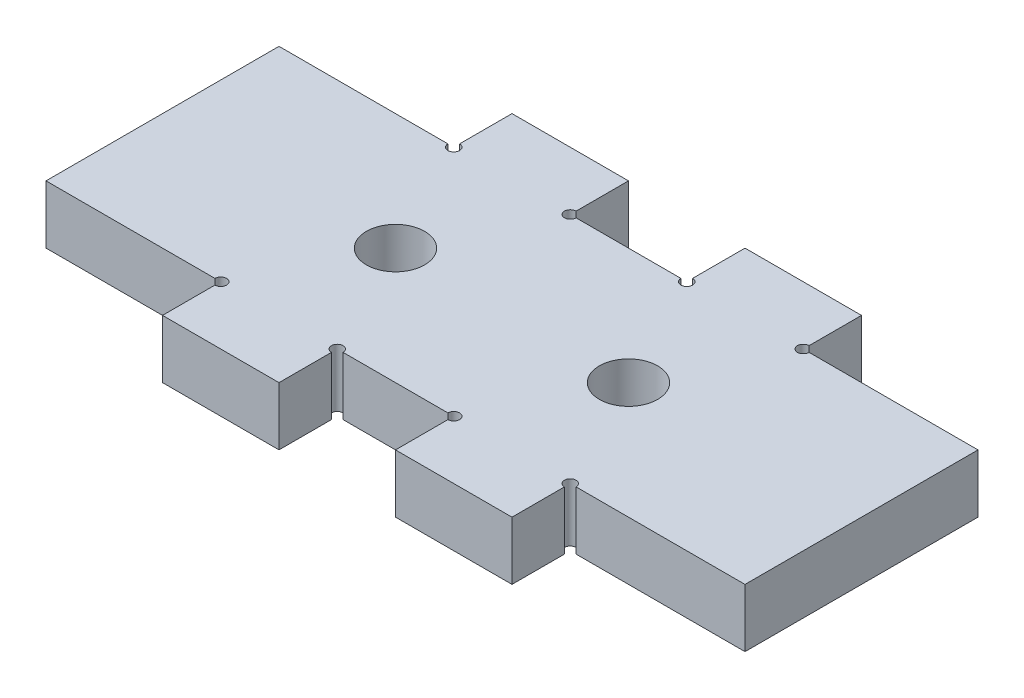
ISO-10303-21;
HEADER;
FILE_DESCRIPTION(('STEP AP214'),'2;1');
FILE_NAME('part.step','',(''),(''),'','','');
FILE_SCHEMA(('AUTOMOTIVE_DESIGN { 1 0 10303 214 1 1 1 1 }'));
ENDSEC;
DATA;
#1=APPLICATION_CONTEXT('core data for automotive mechanical design processes');
#2=APPLICATION_PROTOCOL_DEFINITION('international standard','automotive_design',2000,#1);
#3=PRODUCT_CONTEXT('',#1,'mechanical');
#4=PRODUCT('Part','Part','',(#3));
#5=PRODUCT_RELATED_PRODUCT_CATEGORY('part','',(#4));
#6=PRODUCT_DEFINITION_FORMATION('','',#4);
#7=PRODUCT_DEFINITION_CONTEXT('part definition',#1,'design');
#8=PRODUCT_DEFINITION('design','',#6,#7);
#9=PRODUCT_DEFINITION_SHAPE('','',#8);
#10=(LENGTH_UNIT() NAMED_UNIT(*) SI_UNIT(.MILLI.,.METRE.));
#11=(NAMED_UNIT(*) PLANE_ANGLE_UNIT() SI_UNIT($,.RADIAN.));
#12=(NAMED_UNIT(*) SI_UNIT($,.STERADIAN.) SOLID_ANGLE_UNIT());
#13=UNCERTAINTY_MEASURE_WITH_UNIT(LENGTH_MEASURE(1.E-05),#10,'distance_accuracy_value','');
#14=(GEOMETRIC_REPRESENTATION_CONTEXT(3) GLOBAL_UNCERTAINTY_ASSIGNED_CONTEXT((#13)) GLOBAL_UNIT_ASSIGNED_CONTEXT((#10,
#11,#12)) REPRESENTATION_CONTEXT('',''));
#15=CARTESIAN_POINT('',(0.,0.,0.));
#16=DIRECTION('',(0.,0.,1.));
#17=DIRECTION('',(1.,0.,0.));
#18=AXIS2_PLACEMENT_3D('',#15,#16,#17);
#19=CARTESIAN_POINT('',(19.05,6.35,12.7));
#20=DIRECTION('',(0.,0.,-1.));
#21=DIRECTION('',(-1.,0.,0.));
#22=AXIS2_PLACEMENT_3D('',#19,#20,#21);
#23=PLANE('',#22);
#24=DIRECTION('',(1.,0.,0.));
#25=VECTOR('',#24,1.);
#26=CARTESIAN_POINT('',(19.05,6.35,12.7));
#27=LINE('',#26,#25);
#28=CARTESIAN_POINT('',(19.685,6.35,12.7));
#29=VERTEX_POINT('',#28);
#30=CARTESIAN_POINT('',(38.1,6.35,12.7));
#31=VERTEX_POINT('',#30);
#32=EDGE_CURVE('E303',#29,#31,#27,.T.);
#33=ORIENTED_EDGE('',*,*,#32,.F.);
#34=DIRECTION('',(0.,1.,0.));
#35=VECTOR('',#34,1.);
#36=CARTESIAN_POINT('',(19.685,-0.00100000000000013,12.7));
#37=LINE('',#36,#35);
#38=CARTESIAN_POINT('',(19.685,0.,12.7));
#39=VERTEX_POINT('',#38);
#40=EDGE_CURVE('E453',#39,#29,#37,.T.);
#41=ORIENTED_EDGE('',*,*,#40,.F.);
#42=DIRECTION('',(1.,0.,0.));
#43=VECTOR('',#42,1.);
#44=CARTESIAN_POINT('',(19.05,0.,12.7));
#45=LINE('',#44,#43);
#46=CARTESIAN_POINT('',(38.1,0.,12.7));
#47=VERTEX_POINT('',#46);
#48=EDGE_CURVE('E256',#39,#47,#45,.T.);
#49=ORIENTED_EDGE('',*,*,#48,.T.);
#50=DIRECTION('',(0.,-1.,0.));
#51=VECTOR('',#50,1.);
#52=CARTESIAN_POINT('',(38.1,6.35,12.7));
#53=LINE('',#52,#51);
#54=EDGE_CURVE('E11',#31,#47,#53,.T.);
#55=ORIENTED_EDGE('',*,*,#54,.F.);
#56=EDGE_LOOP('',(#33,#41,#49,#55));
#57=FACE_BOUND('',#56,.T.);
#58=ADVANCED_FACE('F33',(#57),#23,.F.);
#59=CARTESIAN_POINT('',(38.1,6.35,-12.7));
#60=DIRECTION('',(-1.,0.,0.));
#61=DIRECTION('',(0.,0.,1.));
#62=AXIS2_PLACEMENT_3D('',#59,#60,#61);
#63=PLANE('',#62);
#64=DIRECTION('',(0.,0.,-1.));
#65=VECTOR('',#64,1.);
#66=CARTESIAN_POINT('',(38.1,0.,-12.7));
#67=LINE('',#66,#65);
#68=CARTESIAN_POINT('',(38.1,0.,-12.7));
#69=VERTEX_POINT('',#68);
#70=EDGE_CURVE('E258',#47,#69,#67,.T.);
#71=ORIENTED_EDGE('',*,*,#70,.T.);
#72=DIRECTION('',(0.,-1.,0.));
#73=VECTOR('',#72,1.);
#74=CARTESIAN_POINT('',(38.1,6.35,-12.7));
#75=LINE('',#74,#73);
#76=CARTESIAN_POINT('',(38.1,6.35,-12.7));
#77=VERTEX_POINT('',#76);
#78=EDGE_CURVE('E40',#77,#69,#75,.T.);
#79=ORIENTED_EDGE('',*,*,#78,.F.);
#80=DIRECTION('',(0.,0.,-1.));
#81=VECTOR('',#80,1.);
#82=CARTESIAN_POINT('',(38.1,6.35,-12.7));
#83=LINE('',#82,#81);
#84=EDGE_CURVE('E399',#31,#77,#83,.T.);
#85=ORIENTED_EDGE('',*,*,#84,.F.);
#86=ORIENTED_EDGE('',*,*,#54,.T.);
#87=EDGE_LOOP('',(#71,#79,#85,#86));
#88=FACE_BOUND('',#87,.T.);
#89=ADVANCED_FACE('F467',(#88),#63,.F.);
#90=CARTESIAN_POINT('',(19.05,6.35,-12.7));
#91=DIRECTION('',(0.,0.,1.));
#92=DIRECTION('',(1.,0.,0.));
#93=AXIS2_PLACEMENT_3D('',#90,#91,#92);
#94=PLANE('',#93);
#95=DIRECTION('',(-1.,0.,0.));
#96=VECTOR('',#95,1.);
#97=CARTESIAN_POINT('',(19.05,0.,-12.7));
#98=LINE('',#97,#96);
#99=CARTESIAN_POINT('',(19.685,0.,-12.7));
#100=VERTEX_POINT('',#99);
#101=EDGE_CURVE('E261',#69,#100,#98,.T.);
#102=ORIENTED_EDGE('',*,*,#101,.T.);
#103=DIRECTION('',(0.,1.,0.));
#104=VECTOR('',#103,1.);
#105=CARTESIAN_POINT('',(19.685,-0.00100000000000013,-12.7));
#106=LINE('',#105,#104);
#107=CARTESIAN_POINT('',(19.685,6.35,-12.7));
#108=VERTEX_POINT('',#107);
#109=EDGE_CURVE('E357',#108,#100,#106,.F.);
#110=ORIENTED_EDGE('',*,*,#109,.F.);
#111=DIRECTION('',(-1.,0.,0.));
#112=VECTOR('',#111,1.);
#113=CARTESIAN_POINT('',(19.05,6.35,-12.7));
#114=LINE('',#113,#112);
#115=EDGE_CURVE('E338',#77,#108,#114,.T.);
#116=ORIENTED_EDGE('',*,*,#115,.F.);
#117=ORIENTED_EDGE('',*,*,#78,.T.);
#118=EDGE_LOOP('',(#102,#110,#116,#117));
#119=FACE_BOUND('',#118,.T.);
#120=ADVANCED_FACE('F335',(#119),#94,.F.);
#121=CARTESIAN_POINT('',(19.05,6.35,-12.7));
#122=DIRECTION('',(-1.,0.,0.));
#123=DIRECTION('',(0.,0.,1.));
#124=AXIS2_PLACEMENT_3D('',#121,#122,#123);
#125=PLANE('',#124);
#126=DIRECTION('',(0.,0.,-1.));
#127=VECTOR('',#126,1.);
#128=CARTESIAN_POINT('',(19.05,6.35,-12.7));
#129=LINE('',#128,#127);
#130=CARTESIAN_POINT('',(19.05,6.35,-13.335));
#131=VERTEX_POINT('',#130);
#132=CARTESIAN_POINT('',(19.05,6.35,-19.05));
#133=VERTEX_POINT('',#132);
#134=EDGE_CURVE('E402',#131,#133,#129,.T.);
#135=ORIENTED_EDGE('',*,*,#134,.F.);
#136=DIRECTION('',(0.,1.,0.));
#137=VECTOR('',#136,1.);
#138=CARTESIAN_POINT('',(19.05,-0.00100000000000013,-13.335));
#139=LINE('',#138,#137);
#140=CARTESIAN_POINT('',(19.05,0.,-13.335));
#141=VERTEX_POINT('',#140);
#142=EDGE_CURVE('E460',#141,#131,#139,.T.);
#143=ORIENTED_EDGE('',*,*,#142,.F.);
#144=DIRECTION('',(0.,0.,-1.));
#145=VECTOR('',#144,1.);
#146=CARTESIAN_POINT('',(19.05,0.,-12.7));
#147=LINE('',#146,#145);
#148=CARTESIAN_POINT('',(19.05,0.,-19.05));
#149=VERTEX_POINT('',#148);
#150=EDGE_CURVE('E264',#141,#149,#147,.T.);
#151=ORIENTED_EDGE('',*,*,#150,.T.);
#152=DIRECTION('',(0.,-1.,0.));
#153=VECTOR('',#152,1.);
#154=CARTESIAN_POINT('',(19.05,6.35,-19.05));
#155=LINE('',#154,#153);
#156=EDGE_CURVE('E328',#133,#149,#155,.T.);
#157=ORIENTED_EDGE('',*,*,#156,.F.);
#158=EDGE_LOOP('',(#135,#143,#151,#157));
#159=FACE_BOUND('',#158,.T.);
#160=ADVANCED_FACE('F549',(#159),#125,.F.);
#161=CARTESIAN_POINT('',(19.05,6.35,-19.05));
#162=DIRECTION('',(0.,0.,1.));
#163=DIRECTION('',(1.,0.,0.));
#164=AXIS2_PLACEMENT_3D('',#161,#162,#163);
#165=PLANE('',#164);
#166=DIRECTION('',(-1.,0.,0.));
#167=VECTOR('',#166,1.);
#168=CARTESIAN_POINT('',(19.05,0.,-19.05));
#169=LINE('',#168,#167);
#170=CARTESIAN_POINT('',(6.35,0.,-19.05));
#171=VERTEX_POINT('',#170);
#172=EDGE_CURVE('E266',#149,#171,#169,.T.);
#173=ORIENTED_EDGE('',*,*,#172,.T.);
#174=DIRECTION('',(0.,-1.,0.));
#175=VECTOR('',#174,1.);
#176=CARTESIAN_POINT('',(6.35,6.35,-19.05));
#177=LINE('',#176,#175);
#178=CARTESIAN_POINT('',(6.35,6.35,-19.05));
#179=VERTEX_POINT('',#178);
#180=EDGE_CURVE('E325',#179,#171,#177,.T.);
#181=ORIENTED_EDGE('',*,*,#180,.F.);
#182=DIRECTION('',(-1.,0.,0.));
#183=VECTOR('',#182,1.);
#184=CARTESIAN_POINT('',(19.05,6.35,-19.05));
#185=LINE('',#184,#183);
#186=EDGE_CURVE('E404',#133,#179,#185,.T.);
#187=ORIENTED_EDGE('',*,*,#186,.F.);
#188=ORIENTED_EDGE('',*,*,#156,.T.);
#189=EDGE_LOOP('',(#173,#181,#187,#188));
#190=FACE_BOUND('',#189,.T.);
#191=ADVANCED_FACE('F546',(#190),#165,.F.);
#192=CARTESIAN_POINT('',(6.35,6.35,-19.05));
#193=DIRECTION('',(1.,0.,0.));
#194=DIRECTION('',(0.,0.,-1.));
#195=AXIS2_PLACEMENT_3D('',#192,#193,#194);
#196=PLANE('',#195);
#197=DIRECTION('',(0.,0.,1.));
#198=VECTOR('',#197,1.);
#199=CARTESIAN_POINT('',(6.35,0.,-19.05));
#200=LINE('',#199,#198);
#201=CARTESIAN_POINT('',(6.35,0.,-13.335));
#202=VERTEX_POINT('',#201);
#203=EDGE_CURVE('E268',#171,#202,#200,.T.);
#204=ORIENTED_EDGE('',*,*,#203,.T.);
#205=DIRECTION('',(0.,1.,0.));
#206=VECTOR('',#205,1.);
#207=CARTESIAN_POINT('',(6.35,-0.00100000000000013,-13.335));
#208=LINE('',#207,#206);
#209=CARTESIAN_POINT('',(6.35,6.35,-13.335));
#210=VERTEX_POINT('',#209);
#211=EDGE_CURVE('E355',#210,#202,#208,.F.);
#212=ORIENTED_EDGE('',*,*,#211,.F.);
#213=DIRECTION('',(0.,0.,1.));
#214=VECTOR('',#213,1.);
#215=CARTESIAN_POINT('',(6.35,6.35,-19.05));
#216=LINE('',#215,#214);
#217=EDGE_CURVE('E406',#179,#210,#216,.T.);
#218=ORIENTED_EDGE('',*,*,#217,.F.);
#219=ORIENTED_EDGE('',*,*,#180,.T.);
#220=EDGE_LOOP('',(#204,#212,#218,#219));
#221=FACE_BOUND('',#220,.T.);
#222=ADVANCED_FACE('F541',(#221),#196,.F.);
#223=CARTESIAN_POINT('',(-6.35,6.35,-12.7));
#224=DIRECTION('',(0.,0.,1.));
#225=DIRECTION('',(1.,0.,0.));
#226=AXIS2_PLACEMENT_3D('',#223,#224,#225);
#227=PLANE('',#226);
#228=DIRECTION('',(-1.,0.,0.));
#229=VECTOR('',#228,1.);
#230=CARTESIAN_POINT('',(-6.35,6.35,-12.7));
#231=LINE('',#230,#229);
#232=CARTESIAN_POINT('',(5.71500000000001,6.35,-12.7));
#233=VERTEX_POINT('',#232);
#234=CARTESIAN_POINT('',(-5.71500000000001,6.35,-12.7));
#235=VERTEX_POINT('',#234);
#236=EDGE_CURVE('E409',#233,#235,#231,.T.);
#237=ORIENTED_EDGE('',*,*,#236,.F.);
#238=DIRECTION('',(0.,1.,0.));
#239=VECTOR('',#238,1.);
#240=CARTESIAN_POINT('',(5.71500000000001,-0.00100000000000013,-12.7));
#241=LINE('',#240,#239);
#242=CARTESIAN_POINT('',(5.71500000000001,0.,-12.7));
#243=VERTEX_POINT('',#242);
#244=EDGE_CURVE('E352',#243,#233,#241,.T.);
#245=ORIENTED_EDGE('',*,*,#244,.F.);
#246=DIRECTION('',(-1.,0.,0.));
#247=VECTOR('',#246,1.);
#248=CARTESIAN_POINT('',(-6.35,0.,-12.7));
#249=LINE('',#248,#247);
#250=CARTESIAN_POINT('',(-5.71500000000001,0.,-12.7));
#251=VERTEX_POINT('',#250);
#252=EDGE_CURVE('E271',#243,#251,#249,.T.);
#253=ORIENTED_EDGE('',*,*,#252,.T.);
#254=DIRECTION('',(0.,1.,0.));
#255=VECTOR('',#254,1.);
#256=CARTESIAN_POINT('',(-5.71500000000001,-0.00100000000000013,-12.7));
#257=LINE('',#256,#255);
#258=EDGE_CURVE('E369',#235,#251,#257,.F.);
#259=ORIENTED_EDGE('',*,*,#258,.F.);
#260=EDGE_LOOP('',(#237,#245,#253,#259));
#261=FACE_BOUND('',#260,.T.);
#262=ADVANCED_FACE('F535',(#261),#227,.F.);
#263=CARTESIAN_POINT('',(-6.35,6.35,-19.05));
#264=DIRECTION('',(-1.,0.,0.));
#265=DIRECTION('',(0.,0.,1.));
#266=AXIS2_PLACEMENT_3D('',#263,#264,#265);
#267=PLANE('',#266);
#268=DIRECTION('',(0.,0.,-1.));
#269=VECTOR('',#268,1.);
#270=CARTESIAN_POINT('',(-6.35,6.35,-19.05));
#271=LINE('',#270,#269);
#272=CARTESIAN_POINT('',(-6.35,6.35,-13.335));
#273=VERTEX_POINT('',#272);
#274=CARTESIAN_POINT('',(-6.35,6.35,-19.05));
#275=VERTEX_POINT('',#274);
#276=EDGE_CURVE('E411',#273,#275,#271,.T.);
#277=ORIENTED_EDGE('',*,*,#276,.F.);
#278=DIRECTION('',(0.,1.,0.));
#279=VECTOR('',#278,1.);
#280=CARTESIAN_POINT('',(-6.35,-0.00100000000000013,-13.335));
#281=LINE('',#280,#279);
#282=CARTESIAN_POINT('',(-6.35,0.,-13.335));
#283=VERTEX_POINT('',#282);
#284=EDGE_CURVE('E367',#283,#273,#281,.T.);
#285=ORIENTED_EDGE('',*,*,#284,.F.);
#286=DIRECTION('',(0.,0.,-1.));
#287=VECTOR('',#286,1.);
#288=CARTESIAN_POINT('',(-6.35,0.,-19.05));
#289=LINE('',#288,#287);
#290=CARTESIAN_POINT('',(-6.35,0.,-19.05));
#291=VERTEX_POINT('',#290);
#292=EDGE_CURVE('E273',#283,#291,#289,.T.);
#293=ORIENTED_EDGE('',*,*,#292,.T.);
#294=DIRECTION('',(0.,-1.,0.));
#295=VECTOR('',#294,1.);
#296=CARTESIAN_POINT('',(-6.35,6.35,-19.05));
#297=LINE('',#296,#295);
#298=EDGE_CURVE('E322',#275,#291,#297,.T.);
#299=ORIENTED_EDGE('',*,*,#298,.F.);
#300=EDGE_LOOP('',(#277,#285,#293,#299));
#301=FACE_BOUND('',#300,.T.);
#302=ADVANCED_FACE('F525',(#301),#267,.F.);
#303=CARTESIAN_POINT('',(-19.05,6.35,-19.05));
#304=DIRECTION('',(0.,0.,1.));
#305=DIRECTION('',(1.,0.,0.));
#306=AXIS2_PLACEMENT_3D('',#303,#304,#305);
#307=PLANE('',#306);
#308=DIRECTION('',(-1.,0.,0.));
#309=VECTOR('',#308,1.);
#310=CARTESIAN_POINT('',(-19.05,0.,-19.05));
#311=LINE('',#310,#309);
#312=CARTESIAN_POINT('',(-19.05,0.,-19.05));
#313=VERTEX_POINT('',#312);
#314=EDGE_CURVE('E275',#291,#313,#311,.T.);
#315=ORIENTED_EDGE('',*,*,#314,.T.);
#316=DIRECTION('',(0.,-1.,0.));
#317=VECTOR('',#316,1.);
#318=CARTESIAN_POINT('',(-19.05,6.35,-19.05));
#319=LINE('',#318,#317);
#320=CARTESIAN_POINT('',(-19.05,6.35,-19.05));
#321=VERTEX_POINT('',#320);
#322=EDGE_CURVE('E319',#321,#313,#319,.T.);
#323=ORIENTED_EDGE('',*,*,#322,.F.);
#324=DIRECTION('',(-1.,0.,0.));
#325=VECTOR('',#324,1.);
#326=CARTESIAN_POINT('',(-19.05,6.35,-19.05));
#327=LINE('',#326,#325);
#328=EDGE_CURVE('E413',#275,#321,#327,.T.);
#329=ORIENTED_EDGE('',*,*,#328,.F.);
#330=ORIENTED_EDGE('',*,*,#298,.T.);
#331=EDGE_LOOP('',(#315,#323,#329,#330));
#332=FACE_BOUND('',#331,.T.);
#333=ADVANCED_FACE('F521',(#332),#307,.F.);
#334=CARTESIAN_POINT('',(-19.05,6.35,-12.7));
#335=DIRECTION('',(1.,0.,0.));
#336=DIRECTION('',(0.,0.,-1.));
#337=AXIS2_PLACEMENT_3D('',#334,#335,#336);
#338=PLANE('',#337);
#339=DIRECTION('',(0.,0.,1.));
#340=VECTOR('',#339,1.);
#341=CARTESIAN_POINT('',(-19.05,0.,-12.7));
#342=LINE('',#341,#340);
#343=CARTESIAN_POINT('',(-19.05,0.,-13.335));
#344=VERTEX_POINT('',#343);
#345=EDGE_CURVE('E277',#313,#344,#342,.T.);
#346=ORIENTED_EDGE('',*,*,#345,.T.);
#347=DIRECTION('',(0.,1.,0.));
#348=VECTOR('',#347,1.);
#349=CARTESIAN_POINT('',(-19.05,-0.00100000000000013,-13.335));
#350=LINE('',#349,#348);
#351=CARTESIAN_POINT('',(-19.05,6.35,-13.335));
#352=VERTEX_POINT('',#351);
#353=EDGE_CURVE('E380',#352,#344,#350,.F.);
#354=ORIENTED_EDGE('',*,*,#353,.F.);
#355=DIRECTION('',(0.,0.,1.));
#356=VECTOR('',#355,1.);
#357=CARTESIAN_POINT('',(-19.05,6.35,-12.7));
#358=LINE('',#357,#356);
#359=EDGE_CURVE('E415',#321,#352,#358,.T.);
#360=ORIENTED_EDGE('',*,*,#359,.F.);
#361=ORIENTED_EDGE('',*,*,#322,.T.);
#362=EDGE_LOOP('',(#346,#354,#360,#361));
#363=FACE_BOUND('',#362,.T.);
#364=ADVANCED_FACE('F517',(#363),#338,.F.);
#365=CARTESIAN_POINT('',(-38.1,6.35,-12.7));
#366=DIRECTION('',(0.,0.,1.));
#367=DIRECTION('',(1.,0.,0.));
#368=AXIS2_PLACEMENT_3D('',#365,#366,#367);
#369=PLANE('',#368);
#370=DIRECTION('',(-1.,0.,0.));
#371=VECTOR('',#370,1.);
#372=CARTESIAN_POINT('',(-38.1,6.35,-12.7));
#373=LINE('',#372,#371);
#374=CARTESIAN_POINT('',(-19.685,6.35,-12.7));
#375=VERTEX_POINT('',#374);
#376=CARTESIAN_POINT('',(-38.1,6.35,-12.7));
#377=VERTEX_POINT('',#376);
#378=EDGE_CURVE('E418',#375,#377,#373,.T.);
#379=ORIENTED_EDGE('',*,*,#378,.F.);
#380=DIRECTION('',(0.,1.,0.));
#381=VECTOR('',#380,1.);
#382=CARTESIAN_POINT('',(-19.685,-0.00100000000000013,-12.7));
#383=LINE('',#382,#381);
#384=CARTESIAN_POINT('',(-19.685,0.,-12.7));
#385=VERTEX_POINT('',#384);
#386=EDGE_CURVE('E378',#385,#375,#383,.T.);
#387=ORIENTED_EDGE('',*,*,#386,.F.);
#388=DIRECTION('',(-1.,0.,0.));
#389=VECTOR('',#388,1.);
#390=CARTESIAN_POINT('',(-38.1,0.,-12.7));
#391=LINE('',#390,#389);
#392=CARTESIAN_POINT('',(-38.1,0.,-12.7));
#393=VERTEX_POINT('',#392);
#394=EDGE_CURVE('E280',#385,#393,#391,.T.);
#395=ORIENTED_EDGE('',*,*,#394,.T.);
#396=DIRECTION('',(0.,-1.,0.));
#397=VECTOR('',#396,1.);
#398=CARTESIAN_POINT('',(-38.1,6.35,-12.7));
#399=LINE('',#398,#397);
#400=EDGE_CURVE('E316',#377,#393,#399,.T.);
#401=ORIENTED_EDGE('',*,*,#400,.F.);
#402=EDGE_LOOP('',(#379,#387,#395,#401));
#403=FACE_BOUND('',#402,.T.);
#404=ADVANCED_FACE('F509',(#403),#369,.F.);
#405=CARTESIAN_POINT('',(-38.1,6.35,-12.7));
#406=DIRECTION('',(1.,0.,0.));
#407=DIRECTION('',(0.,0.,-1.));
#408=AXIS2_PLACEMENT_3D('',#405,#406,#407);
#409=PLANE('',#408);
#410=DIRECTION('',(0.,0.,1.));
#411=VECTOR('',#410,1.);
#412=CARTESIAN_POINT('',(-38.1,0.,-12.7));
#413=LINE('',#412,#411);
#414=CARTESIAN_POINT('',(-38.1,0.,12.7));
#415=VERTEX_POINT('',#414);
#416=EDGE_CURVE('E282',#393,#415,#413,.T.);
#417=ORIENTED_EDGE('',*,*,#416,.T.);
#418=DIRECTION('',(0.,-1.,0.));
#419=VECTOR('',#418,1.);
#420=CARTESIAN_POINT('',(-38.1,6.35,12.7));
#421=LINE('',#420,#419);
#422=CARTESIAN_POINT('',(-38.1,6.35,12.7));
#423=VERTEX_POINT('',#422);
#424=EDGE_CURVE('E313',#423,#415,#421,.T.);
#425=ORIENTED_EDGE('',*,*,#424,.F.);
#426=DIRECTION('',(0.,0.,1.));
#427=VECTOR('',#426,1.);
#428=CARTESIAN_POINT('',(-38.1,6.35,-12.7));
#429=LINE('',#428,#427);
#430=EDGE_CURVE('E240',#377,#423,#429,.T.);
#431=ORIENTED_EDGE('',*,*,#430,.F.);
#432=ORIENTED_EDGE('',*,*,#400,.T.);
#433=EDGE_LOOP('',(#417,#425,#431,#432));
#434=FACE_BOUND('',#433,.T.);
#435=ADVANCED_FACE('F425',(#434),#409,.F.);
#436=CARTESIAN_POINT('',(-38.1,6.35,12.7));
#437=DIRECTION('',(0.,0.,-1.));
#438=DIRECTION('',(-1.,0.,0.));
#439=AXIS2_PLACEMENT_3D('',#436,#437,#438);
#440=PLANE('',#439);
#441=DIRECTION('',(1.,0.,0.));
#442=VECTOR('',#441,1.);
#443=CARTESIAN_POINT('',(-38.1,0.,12.7));
#444=LINE('',#443,#442);
#445=CARTESIAN_POINT('',(-19.685,0.,12.7));
#446=VERTEX_POINT('',#445);
#447=EDGE_CURVE('E284',#415,#446,#444,.T.);
#448=ORIENTED_EDGE('',*,*,#447,.T.);
#449=DIRECTION('',(0.,1.,0.));
#450=VECTOR('',#449,1.);
#451=CARTESIAN_POINT('',(-19.685,-0.00100000000000013,12.7));
#452=LINE('',#451,#450);
#453=CARTESIAN_POINT('',(-19.685,6.35,12.7));
#454=VERTEX_POINT('',#453);
#455=EDGE_CURVE('E47',#454,#446,#452,.F.);
#456=ORIENTED_EDGE('',*,*,#455,.F.);
#457=DIRECTION('',(1.,0.,0.));
#458=VECTOR('',#457,1.);
#459=CARTESIAN_POINT('',(-38.1,6.35,12.7));
#460=LINE('',#459,#458);
#461=EDGE_CURVE('E230',#423,#454,#460,.T.);
#462=ORIENTED_EDGE('',*,*,#461,.F.);
#463=ORIENTED_EDGE('',*,*,#424,.T.);
#464=EDGE_LOOP('',(#448,#456,#462,#463));
#465=FACE_BOUND('',#464,.T.);
#466=ADVANCED_FACE('F429',(#465),#440,.F.);
#467=CARTESIAN_POINT('',(-19.05,6.35,12.7));
#468=DIRECTION('',(1.,0.,0.));
#469=DIRECTION('',(0.,0.,-1.));
#470=AXIS2_PLACEMENT_3D('',#467,#468,#469);
#471=PLANE('',#470);
#472=DIRECTION('',(0.,0.,1.));
#473=VECTOR('',#472,1.);
#474=CARTESIAN_POINT('',(-19.05,6.35,12.7));
#475=LINE('',#474,#473);
#476=CARTESIAN_POINT('',(-19.05,6.35,13.335));
#477=VERTEX_POINT('',#476);
#478=CARTESIAN_POINT('',(-19.05,6.35,19.05));
#479=VERTEX_POINT('',#478);
#480=EDGE_CURVE('E227',#477,#479,#475,.T.);
#481=ORIENTED_EDGE('',*,*,#480,.F.);
#482=DIRECTION('',(0.,1.,0.));
#483=VECTOR('',#482,1.);
#484=CARTESIAN_POINT('',(-19.05,-0.00100000000000013,13.335));
#485=LINE('',#484,#483);
#486=CARTESIAN_POINT('',(-19.05,0.,13.335));
#487=VERTEX_POINT('',#486);
#488=EDGE_CURVE('E215',#487,#477,#485,.T.);
#489=ORIENTED_EDGE('',*,*,#488,.F.);
#490=DIRECTION('',(0.,0.,1.));
#491=VECTOR('',#490,1.);
#492=CARTESIAN_POINT('',(-19.05,0.,12.7));
#493=LINE('',#492,#491);
#494=CARTESIAN_POINT('',(-19.05,0.,19.05));
#495=VERTEX_POINT('',#494);
#496=EDGE_CURVE('E287',#487,#495,#493,.T.);
#497=ORIENTED_EDGE('',*,*,#496,.T.);
#498=DIRECTION('',(0.,-1.,0.));
#499=VECTOR('',#498,1.);
#500=CARTESIAN_POINT('',(-19.05,6.35,19.05));
#501=LINE('',#500,#499);
#502=EDGE_CURVE('E234',#479,#495,#501,.T.);
#503=ORIENTED_EDGE('',*,*,#502,.F.);
#504=EDGE_LOOP('',(#481,#489,#497,#503));
#505=FACE_BOUND('',#504,.T.);
#506=ADVANCED_FACE('F232',(#505),#471,.F.);
#507=CARTESIAN_POINT('',(-19.05,6.35,19.05));
#508=DIRECTION('',(0.,0.,-1.));
#509=DIRECTION('',(-1.,0.,0.));
#510=AXIS2_PLACEMENT_3D('',#507,#508,#509);
#511=PLANE('',#510);
#512=DIRECTION('',(1.,0.,0.));
#513=VECTOR('',#512,1.);
#514=CARTESIAN_POINT('',(-19.05,0.,19.05));
#515=LINE('',#514,#513);
#516=CARTESIAN_POINT('',(-6.35,0.,19.05));
#517=VERTEX_POINT('',#516);
#518=EDGE_CURVE('E289',#495,#517,#515,.T.);
#519=ORIENTED_EDGE('',*,*,#518,.T.);
#520=DIRECTION('',(0.,-1.,0.));
#521=VECTOR('',#520,1.);
#522=CARTESIAN_POINT('',(-6.35,6.35,19.05));
#523=LINE('',#522,#521);
#524=CARTESIAN_POINT('',(-6.35,6.35,19.05));
#525=VERTEX_POINT('',#524);
#526=EDGE_CURVE('E309',#525,#517,#523,.T.);
#527=ORIENTED_EDGE('',*,*,#526,.F.);
#528=DIRECTION('',(1.,0.,0.));
#529=VECTOR('',#528,1.);
#530=CARTESIAN_POINT('',(-19.05,6.35,19.05));
#531=LINE('',#530,#529);
#532=EDGE_CURVE('E236',#479,#525,#531,.T.);
#533=ORIENTED_EDGE('',*,*,#532,.F.);
#534=ORIENTED_EDGE('',*,*,#502,.T.);
#535=EDGE_LOOP('',(#519,#527,#533,#534));
#536=FACE_BOUND('',#535,.T.);
#537=ADVANCED_FACE('F504',(#536),#511,.F.);
#538=CARTESIAN_POINT('',(-6.35,6.35,19.05));
#539=DIRECTION('',(-1.,0.,0.));
#540=DIRECTION('',(0.,0.,1.));
#541=AXIS2_PLACEMENT_3D('',#538,#539,#540);
#542=PLANE('',#541);
#543=DIRECTION('',(0.,0.,-1.));
#544=VECTOR('',#543,1.);
#545=CARTESIAN_POINT('',(-6.35,0.,19.05));
#546=LINE('',#545,#544);
#547=CARTESIAN_POINT('',(-6.35,0.,13.335));
#548=VERTEX_POINT('',#547);
#549=EDGE_CURVE('E291',#517,#548,#546,.T.);
#550=ORIENTED_EDGE('',*,*,#549,.T.);
#551=DIRECTION('',(0.,1.,0.));
#552=VECTOR('',#551,1.);
#553=CARTESIAN_POINT('',(-6.35,-0.00100000000000013,13.335));
#554=LINE('',#553,#552);
#555=CARTESIAN_POINT('',(-6.35,6.35,13.335));
#556=VERTEX_POINT('',#555);
#557=EDGE_CURVE('E55',#556,#548,#554,.F.);
#558=ORIENTED_EDGE('',*,*,#557,.F.);
#559=DIRECTION('',(0.,0.,-1.));
#560=VECTOR('',#559,1.);
#561=CARTESIAN_POINT('',(-6.35,6.35,19.05));
#562=LINE('',#561,#560);
#563=EDGE_CURVE('E238',#525,#556,#562,.T.);
#564=ORIENTED_EDGE('',*,*,#563,.F.);
#565=ORIENTED_EDGE('',*,*,#526,.T.);
#566=EDGE_LOOP('',(#550,#558,#564,#565));
#567=FACE_BOUND('',#566,.T.);
#568=ADVANCED_FACE('F500',(#567),#542,.F.);
#569=CARTESIAN_POINT('',(-6.35,6.35,12.7));
#570=DIRECTION('',(0.,0.,-1.));
#571=DIRECTION('',(-1.,0.,0.));
#572=AXIS2_PLACEMENT_3D('',#569,#570,#571);
#573=PLANE('',#572);
#574=DIRECTION('',(1.,0.,0.));
#575=VECTOR('',#574,1.);
#576=CARTESIAN_POINT('',(-6.35,6.35,12.7));
#577=LINE('',#576,#575);
#578=CARTESIAN_POINT('',(-5.71500000000001,6.35,12.7));
#579=VERTEX_POINT('',#578);
#580=CARTESIAN_POINT('',(5.71500000000001,6.35,12.7));
#581=VERTEX_POINT('',#580);
#582=EDGE_CURVE('E246',#579,#581,#577,.T.);
#583=ORIENTED_EDGE('',*,*,#582,.F.);
#584=DIRECTION('',(0.,1.,0.));
#585=VECTOR('',#584,1.);
#586=CARTESIAN_POINT('',(-5.71500000000001,-0.00100000000000013,12.7));
#587=LINE('',#586,#585);
#588=CARTESIAN_POINT('',(-5.71500000000001,0.,12.7));
#589=VERTEX_POINT('',#588);
#590=EDGE_CURVE('E433',#589,#579,#587,.T.);
#591=ORIENTED_EDGE('',*,*,#590,.F.);
#592=DIRECTION('',(1.,0.,0.));
#593=VECTOR('',#592,1.);
#594=CARTESIAN_POINT('',(-6.35,0.,12.7));
#595=LINE('',#594,#593);
#596=CARTESIAN_POINT('',(5.71500000000001,0.,12.7));
#597=VERTEX_POINT('',#596);
#598=EDGE_CURVE('E294',#589,#597,#595,.T.);
#599=ORIENTED_EDGE('',*,*,#598,.T.);
#600=DIRECTION('',(0.,1.,0.));
#601=VECTOR('',#600,1.);
#602=CARTESIAN_POINT('',(5.71500000000001,-0.00100000000000013,12.7));
#603=LINE('',#602,#601);
#604=EDGE_CURVE('E442',#581,#597,#603,.F.);
#605=ORIENTED_EDGE('',*,*,#604,.F.);
#606=EDGE_LOOP('',(#583,#591,#599,#605));
#607=FACE_BOUND('',#606,.T.);
#608=ADVANCED_FACE('F496',(#607),#573,.F.);
#609=CARTESIAN_POINT('',(6.35,6.35,19.05));
#610=DIRECTION('',(1.,0.,0.));
#611=DIRECTION('',(0.,0.,-1.));
#612=AXIS2_PLACEMENT_3D('',#609,#610,#611);
#613=PLANE('',#612);
#614=DIRECTION('',(0.,0.,1.));
#615=VECTOR('',#614,1.);
#616=CARTESIAN_POINT('',(6.35,6.35,19.05));
#617=LINE('',#616,#615);
#618=CARTESIAN_POINT('',(6.35,6.35,13.335));
#619=VERTEX_POINT('',#618);
#620=CARTESIAN_POINT('',(6.35,6.35,19.05));
#621=VERTEX_POINT('',#620);
#622=EDGE_CURVE('E248',#619,#621,#617,.T.);
#623=ORIENTED_EDGE('',*,*,#622,.F.);
#624=DIRECTION('',(0.,1.,0.));
#625=VECTOR('',#624,1.);
#626=CARTESIAN_POINT('',(6.35,-0.00100000000000013,13.335));
#627=LINE('',#626,#625);
#628=CARTESIAN_POINT('',(6.35,0.,13.335));
#629=VERTEX_POINT('',#628);
#630=EDGE_CURVE('E440',#629,#619,#627,.T.);
#631=ORIENTED_EDGE('',*,*,#630,.F.);
#632=DIRECTION('',(0.,0.,1.));
#633=VECTOR('',#632,1.);
#634=CARTESIAN_POINT('',(6.35,0.,19.05));
#635=LINE('',#634,#633);
#636=CARTESIAN_POINT('',(6.35,0.,19.05));
#637=VERTEX_POINT('',#636);
#638=EDGE_CURVE('E296',#629,#637,#635,.T.);
#639=ORIENTED_EDGE('',*,*,#638,.T.);
#640=DIRECTION('',(0.,-1.,0.));
#641=VECTOR('',#640,1.);
#642=CARTESIAN_POINT('',(6.35,6.35,19.05));
#643=LINE('',#642,#641);
#644=EDGE_CURVE('E306',#621,#637,#643,.T.);
#645=ORIENTED_EDGE('',*,*,#644,.F.);
#646=EDGE_LOOP('',(#623,#631,#639,#645));
#647=FACE_BOUND('',#646,.T.);
#648=ADVANCED_FACE('F487',(#647),#613,.F.);
#649=CARTESIAN_POINT('',(19.05,6.35,19.05));
#650=DIRECTION('',(0.,0.,-1.));
#651=DIRECTION('',(-1.,0.,0.));
#652=AXIS2_PLACEMENT_3D('',#649,#650,#651);
#653=PLANE('',#652);
#654=DIRECTION('',(1.,0.,0.));
#655=VECTOR('',#654,1.);
#656=CARTESIAN_POINT('',(19.05,0.,19.05));
#657=LINE('',#656,#655);
#658=CARTESIAN_POINT('',(19.05,0.,19.05));
#659=VERTEX_POINT('',#658);
#660=EDGE_CURVE('E298',#637,#659,#657,.T.);
#661=ORIENTED_EDGE('',*,*,#660,.T.);
#662=DIRECTION('',(0.,-1.,0.));
#663=VECTOR('',#662,1.);
#664=CARTESIAN_POINT('',(19.05,6.35,19.05));
#665=LINE('',#664,#663);
#666=CARTESIAN_POINT('',(19.05,6.35,19.05));
#667=VERTEX_POINT('',#666);
#668=EDGE_CURVE('E255',#667,#659,#665,.T.);
#669=ORIENTED_EDGE('',*,*,#668,.F.);
#670=DIRECTION('',(1.,0.,0.));
#671=VECTOR('',#670,1.);
#672=CARTESIAN_POINT('',(19.05,6.35,19.05));
#673=LINE('',#672,#671);
#674=EDGE_CURVE('E250',#621,#667,#673,.T.);
#675=ORIENTED_EDGE('',*,*,#674,.F.);
#676=ORIENTED_EDGE('',*,*,#644,.T.);
#677=EDGE_LOOP('',(#661,#669,#675,#676));
#678=FACE_BOUND('',#677,.T.);
#679=ADVANCED_FACE('F480',(#678),#653,.F.);
#680=CARTESIAN_POINT('',(19.05,6.35,12.7));
#681=DIRECTION('',(-1.,0.,0.));
#682=DIRECTION('',(0.,0.,1.));
#683=AXIS2_PLACEMENT_3D('',#680,#681,#682);
#684=PLANE('',#683);
#685=DIRECTION('',(0.,0.,-1.));
#686=VECTOR('',#685,1.);
#687=CARTESIAN_POINT('',(19.05,0.,12.7));
#688=LINE('',#687,#686);
#689=CARTESIAN_POINT('',(19.05,0.,13.335));
#690=VERTEX_POINT('',#689);
#691=EDGE_CURVE('E300',#659,#690,#688,.T.);
#692=ORIENTED_EDGE('',*,*,#691,.T.);
#693=DIRECTION('',(0.,1.,0.));
#694=VECTOR('',#693,1.);
#695=CARTESIAN_POINT('',(19.05,-0.00100000000000013,13.335));
#696=LINE('',#695,#694);
#697=CARTESIAN_POINT('',(19.05,6.35,13.335));
#698=VERTEX_POINT('',#697);
#699=EDGE_CURVE('E451',#698,#690,#696,.F.);
#700=ORIENTED_EDGE('',*,*,#699,.F.);
#701=DIRECTION('',(0.,0.,-1.));
#702=VECTOR('',#701,1.);
#703=CARTESIAN_POINT('',(19.05,6.35,12.7));
#704=LINE('',#703,#702);
#705=EDGE_CURVE('E252',#667,#698,#704,.T.);
#706=ORIENTED_EDGE('',*,*,#705,.F.);
#707=ORIENTED_EDGE('',*,*,#668,.T.);
#708=EDGE_LOOP('',(#692,#700,#706,#707));
#709=FACE_BOUND('',#708,.T.);
#710=ADVANCED_FACE('F475',(#709),#684,.F.);
#711=CARTESIAN_POINT('',(38.1,6.35,12.7));
#712=DIRECTION('',(0.,-1.,0.));
#713=DIRECTION('',(0.,0.,-1.));
#714=AXIS2_PLACEMENT_3D('',#711,#712,#713);
#715=PLANE('',#714);
#716=CARTESIAN_POINT('',(12.7,6.35,0.));
#717=DIRECTION('',(0.,1.,0.));
#718=DIRECTION('',(0.,0.,1.));
#719=AXIS2_PLACEMENT_3D('',#716,#717,#718);
#720=CIRCLE('',#719,3.17500000000001);
#721=CARTESIAN_POINT('',(12.7,6.35,3.17500000000001));
#722=VERTEX_POINT('',#721);
#723=EDGE_CURVE('E388',#722,#722,#720,.T.);
#724=ORIENTED_EDGE('',*,*,#723,.F.);
#725=EDGE_LOOP('',(#724));
#726=FACE_BOUND('',#725,.T.);
#727=CARTESIAN_POINT('',(-12.7,6.35,0.));
#728=DIRECTION('',(0.,1.,0.));
#729=DIRECTION('',(0.,0.,1.));
#730=AXIS2_PLACEMENT_3D('',#727,#728,#729);
#731=CIRCLE('',#730,3.175);
#732=CARTESIAN_POINT('',(-12.7,6.35,3.175));
#733=VERTEX_POINT('',#732);
#734=EDGE_CURVE('E259',#733,#733,#731,.T.);
#735=ORIENTED_EDGE('',*,*,#734,.F.);
#736=EDGE_LOOP('',(#735));
#737=FACE_BOUND('',#736,.T.);
#738=ORIENTED_EDGE('',*,*,#461,.T.);
#739=CARTESIAN_POINT('',(-19.05,6.35,12.7));
#740=DIRECTION('',(0.,1.,0.));
#741=DIRECTION('',(0.,0.,1.));
#742=AXIS2_PLACEMENT_3D('',#739,#740,#741);
#743=CIRCLE('',#742,0.634999999999995);
#744=EDGE_CURVE('E218',#477,#454,#743,.T.);
#745=ORIENTED_EDGE('',*,*,#744,.F.);
#746=ORIENTED_EDGE('',*,*,#480,.T.);
#747=ORIENTED_EDGE('',*,*,#532,.T.);
#748=ORIENTED_EDGE('',*,*,#563,.T.);
#749=CARTESIAN_POINT('',(-6.35,6.35,12.7));
#750=DIRECTION('',(0.,1.,0.));
#751=DIRECTION('',(0.,0.,1.));
#752=AXIS2_PLACEMENT_3D('',#749,#750,#751);
#753=CIRCLE('',#752,0.634999999999995);
#754=EDGE_CURVE('E436',#579,#556,#753,.T.);
#755=ORIENTED_EDGE('',*,*,#754,.F.);
#756=ORIENTED_EDGE('',*,*,#582,.T.);
#757=CARTESIAN_POINT('',(6.35,6.35,12.7));
#758=DIRECTION('',(0.,1.,0.));
#759=DIRECTION('',(0.,0.,1.));
#760=AXIS2_PLACEMENT_3D('',#757,#758,#759);
#761=CIRCLE('',#760,0.634999999999995);
#762=EDGE_CURVE('E445',#619,#581,#761,.T.);
#763=ORIENTED_EDGE('',*,*,#762,.F.);
#764=ORIENTED_EDGE('',*,*,#622,.T.);
#765=ORIENTED_EDGE('',*,*,#674,.T.);
#766=ORIENTED_EDGE('',*,*,#705,.T.);
#767=CARTESIAN_POINT('',(19.05,6.35,12.7));
#768=DIRECTION('',(0.,1.,0.));
#769=DIRECTION('',(0.,0.,1.));
#770=AXIS2_PLACEMENT_3D('',#767,#768,#769);
#771=CIRCLE('',#770,0.634999999999995);
#772=EDGE_CURVE('E455',#29,#698,#771,.T.);
#773=ORIENTED_EDGE('',*,*,#772,.F.);
#774=ORIENTED_EDGE('',*,*,#32,.T.);
#775=ORIENTED_EDGE('',*,*,#84,.T.);
#776=ORIENTED_EDGE('',*,*,#115,.T.);
#777=CARTESIAN_POINT('',(19.05,6.35,-12.7));
#778=DIRECTION('',(0.,1.,0.));
#779=DIRECTION('',(0.,0.,1.));
#780=AXIS2_PLACEMENT_3D('',#777,#778,#779);
#781=CIRCLE('',#780,0.634999999999995);
#782=EDGE_CURVE('E353',#131,#108,#781,.T.);
#783=ORIENTED_EDGE('',*,*,#782,.F.);
#784=ORIENTED_EDGE('',*,*,#134,.T.);
#785=ORIENTED_EDGE('',*,*,#186,.T.);
#786=ORIENTED_EDGE('',*,*,#217,.T.);
#787=CARTESIAN_POINT('',(6.35,6.35,-12.7));
#788=DIRECTION('',(0.,1.,0.));
#789=DIRECTION('',(0.,0.,1.));
#790=AXIS2_PLACEMENT_3D('',#787,#788,#789);
#791=CIRCLE('',#790,0.634999999999995);
#792=EDGE_CURVE('E362',#233,#210,#791,.T.);
#793=ORIENTED_EDGE('',*,*,#792,.F.);
#794=ORIENTED_EDGE('',*,*,#236,.T.);
#795=CARTESIAN_POINT('',(-6.35,6.35,-12.7));
#796=DIRECTION('',(0.,1.,0.));
#797=DIRECTION('',(0.,0.,1.));
#798=AXIS2_PLACEMENT_3D('',#795,#796,#797);
#799=CIRCLE('',#798,0.634999999999995);
#800=EDGE_CURVE('E372',#273,#235,#799,.T.);
#801=ORIENTED_EDGE('',*,*,#800,.F.);
#802=ORIENTED_EDGE('',*,*,#276,.T.);
#803=ORIENTED_EDGE('',*,*,#328,.T.);
#804=ORIENTED_EDGE('',*,*,#359,.T.);
#805=CARTESIAN_POINT('',(-19.05,6.35,-12.7));
#806=DIRECTION('',(0.,1.,0.));
#807=DIRECTION('',(0.,0.,1.));
#808=AXIS2_PLACEMENT_3D('',#805,#806,#807);
#809=CIRCLE('',#808,0.634999999999995);
#810=EDGE_CURVE('E382',#375,#352,#809,.T.);
#811=ORIENTED_EDGE('',*,*,#810,.F.);
#812=ORIENTED_EDGE('',*,*,#378,.T.);
#813=ORIENTED_EDGE('',*,*,#430,.T.);
#814=EDGE_LOOP('',(#738,#745,#746,#747,#748,#755,#756,#763,#764,#765,#766,#773,#774,#775,#776,
#783,#784,#785,#786,#793,#794,#801,#802,#803,#804,#811,#812,#813));
#815=FACE_BOUND('',#814,.T.);
#816=ADVANCED_FACE('F226',(#726,#737,#815),#715,.F.);
#817=CARTESIAN_POINT('',(38.1,0.,12.7));
#818=DIRECTION('',(0.,-1.,0.));
#819=DIRECTION('',(0.,0.,-1.));
#820=AXIS2_PLACEMENT_3D('',#817,#818,#819);
#821=PLANE('',#820);
#822=CARTESIAN_POINT('',(-19.05,0.,12.7));
#823=DIRECTION('',(0.,-1.,0.));
#824=DIRECTION('',(0.,0.,-1.));
#825=AXIS2_PLACEMENT_3D('',#822,#823,#824);
#826=CIRCLE('',#825,0.634999999999995);
#827=EDGE_CURVE('E219',#487,#446,#826,.F.);
#828=ORIENTED_EDGE('',*,*,#827,.T.);
#829=ORIENTED_EDGE('',*,*,#447,.F.);
#830=ORIENTED_EDGE('',*,*,#416,.F.);
#831=ORIENTED_EDGE('',*,*,#394,.F.);
#832=CARTESIAN_POINT('',(-19.05,0.,-12.7));
#833=DIRECTION('',(0.,-1.,0.));
#834=DIRECTION('',(0.,0.,-1.));
#835=AXIS2_PLACEMENT_3D('',#832,#833,#834);
#836=CIRCLE('',#835,0.634999999999995);
#837=EDGE_CURVE('E384',#385,#344,#836,.F.);
#838=ORIENTED_EDGE('',*,*,#837,.T.);
#839=ORIENTED_EDGE('',*,*,#345,.F.);
#840=ORIENTED_EDGE('',*,*,#314,.F.);
#841=ORIENTED_EDGE('',*,*,#292,.F.);
#842=CARTESIAN_POINT('',(-6.35,0.,-12.7));
#843=DIRECTION('',(0.,-1.,0.));
#844=DIRECTION('',(0.,0.,-1.));
#845=AXIS2_PLACEMENT_3D('',#842,#843,#844);
#846=CIRCLE('',#845,0.634999999999995);
#847=EDGE_CURVE('E375',#283,#251,#846,.F.);
#848=ORIENTED_EDGE('',*,*,#847,.T.);
#849=ORIENTED_EDGE('',*,*,#252,.F.);
#850=CARTESIAN_POINT('',(6.35,0.,-12.7));
#851=DIRECTION('',(0.,-1.,0.));
#852=DIRECTION('',(0.,0.,-1.));
#853=AXIS2_PLACEMENT_3D('',#850,#851,#852);
#854=CIRCLE('',#853,0.634999999999995);
#855=EDGE_CURVE('E364',#243,#202,#854,.F.);
#856=ORIENTED_EDGE('',*,*,#855,.T.);
#857=ORIENTED_EDGE('',*,*,#203,.F.);
#858=ORIENTED_EDGE('',*,*,#172,.F.);
#859=ORIENTED_EDGE('',*,*,#150,.F.);
#860=CARTESIAN_POINT('',(19.05,0.,-12.7));
#861=DIRECTION('',(0.,-1.,0.));
#862=DIRECTION('',(0.,0.,-1.));
#863=AXIS2_PLACEMENT_3D('',#860,#861,#862);
#864=CIRCLE('',#863,0.634999999999995);
#865=EDGE_CURVE('E348',#141,#100,#864,.F.);
#866=ORIENTED_EDGE('',*,*,#865,.T.);
#867=ORIENTED_EDGE('',*,*,#101,.F.);
#868=ORIENTED_EDGE('',*,*,#70,.F.);
#869=ORIENTED_EDGE('',*,*,#48,.F.);
#870=CARTESIAN_POINT('',(19.05,0.,12.7));
#871=DIRECTION('',(0.,-1.,0.));
#872=DIRECTION('',(0.,0.,-1.));
#873=AXIS2_PLACEMENT_3D('',#870,#871,#872);
#874=CIRCLE('',#873,0.634999999999995);
#875=EDGE_CURVE('E457',#39,#690,#874,.F.);
#876=ORIENTED_EDGE('',*,*,#875,.T.);
#877=ORIENTED_EDGE('',*,*,#691,.F.);
#878=ORIENTED_EDGE('',*,*,#660,.F.);
#879=ORIENTED_EDGE('',*,*,#638,.F.);
#880=CARTESIAN_POINT('',(6.35,0.,12.7));
#881=DIRECTION('',(0.,-1.,0.));
#882=DIRECTION('',(0.,0.,-1.));
#883=AXIS2_PLACEMENT_3D('',#880,#881,#882);
#884=CIRCLE('',#883,0.634999999999995);
#885=EDGE_CURVE('E448',#629,#597,#884,.F.);
#886=ORIENTED_EDGE('',*,*,#885,.T.);
#887=ORIENTED_EDGE('',*,*,#598,.F.);
#888=CARTESIAN_POINT('',(-6.35,0.,12.7));
#889=DIRECTION('',(0.,-1.,0.));
#890=DIRECTION('',(0.,0.,-1.));
#891=AXIS2_PLACEMENT_3D('',#888,#889,#890);
#892=CIRCLE('',#891,0.634999999999995);
#893=EDGE_CURVE('E438',#589,#548,#892,.F.);
#894=ORIENTED_EDGE('',*,*,#893,.T.);
#895=ORIENTED_EDGE('',*,*,#549,.F.);
#896=ORIENTED_EDGE('',*,*,#518,.F.);
#897=ORIENTED_EDGE('',*,*,#496,.F.);
#898=EDGE_LOOP('',(#828,#829,#830,#831,#838,#839,#840,#841,#848,#849,#856,#857,#858,#859,#866,
#867,#868,#869,#876,#877,#878,#879,#886,#887,#894,#895,#896,#897));
#899=FACE_BOUND('',#898,.T.);
#900=CARTESIAN_POINT('',(12.7,0.,0.));
#901=DIRECTION('',(0.,-1.,0.));
#902=DIRECTION('',(0.,0.,-1.));
#903=AXIS2_PLACEMENT_3D('',#900,#901,#902);
#904=CIRCLE('',#903,3.17500000000001);
#905=CARTESIAN_POINT('',(12.7,0.,-3.17500000000001));
#906=VERTEX_POINT('',#905);
#907=EDGE_CURVE('E387',#906,#906,#904,.F.);
#908=ORIENTED_EDGE('',*,*,#907,.T.);
#909=EDGE_LOOP('',(#908));
#910=FACE_BOUND('',#909,.T.);
#911=CARTESIAN_POINT('',(-12.7,0.,0.));
#912=DIRECTION('',(0.,-1.,0.));
#913=DIRECTION('',(0.,0.,-1.));
#914=AXIS2_PLACEMENT_3D('',#911,#912,#913);
#915=CIRCLE('',#914,3.175);
#916=CARTESIAN_POINT('',(-12.7,0.,-3.175));
#917=VERTEX_POINT('',#916);
#918=EDGE_CURVE('E391',#917,#917,#915,.F.);
#919=ORIENTED_EDGE('',*,*,#918,.T.);
#920=EDGE_LOOP('',(#919));
#921=FACE_BOUND('',#920,.T.);
#922=ADVANCED_FACE('F344',(#899,#910,#921),#821,.T.);
#923=CARTESIAN_POINT('',(-12.7,-0.00100000000000013,0.));
#924=DIRECTION('',(0.,1.,0.));
#925=DIRECTION('',(0.,0.,1.));
#926=AXIS2_PLACEMENT_3D('',#923,#924,#925);
#927=CYLINDRICAL_SURFACE('',#926,3.175);
#928=ORIENTED_EDGE('',*,*,#918,.F.);
#929=EDGE_LOOP('',(#928));
#930=FACE_BOUND('',#929,.T.);
#931=ORIENTED_EDGE('',*,*,#734,.T.);
#932=EDGE_LOOP('',(#931));
#933=FACE_BOUND('',#932,.T.);
#934=ADVANCED_FACE('F675',(#930,#933),#927,.F.);
#935=CARTESIAN_POINT('',(12.7,-0.00100000000000013,0.));
#936=DIRECTION('',(0.,1.,0.));
#937=DIRECTION('',(0.,0.,1.));
#938=AXIS2_PLACEMENT_3D('',#935,#936,#937);
#939=CYLINDRICAL_SURFACE('',#938,3.17500000000001);
#940=ORIENTED_EDGE('',*,*,#907,.F.);
#941=EDGE_LOOP('',(#940));
#942=FACE_BOUND('',#941,.T.);
#943=ORIENTED_EDGE('',*,*,#723,.T.);
#944=EDGE_LOOP('',(#943));
#945=FACE_BOUND('',#944,.T.);
#946=ADVANCED_FACE('F744',(#942,#945),#939,.F.);
#947=CARTESIAN_POINT('',(-19.05,-0.00100000000000013,-12.7));
#948=DIRECTION('',(0.,1.,0.));
#949=DIRECTION('',(0.,0.,1.));
#950=AXIS2_PLACEMENT_3D('',#947,#948,#949);
#951=CYLINDRICAL_SURFACE('',#950,0.634999999999995);
#952=ORIENTED_EDGE('',*,*,#353,.T.);
#953=ORIENTED_EDGE('',*,*,#837,.F.);
#954=ORIENTED_EDGE('',*,*,#386,.T.);
#955=ORIENTED_EDGE('',*,*,#810,.T.);
#956=EDGE_LOOP('',(#952,#953,#954,#955));
#957=FACE_BOUND('',#956,.T.);
#958=ADVANCED_FACE('F511',(#957),#951,.F.);
#959=CARTESIAN_POINT('',(-6.35,-0.00100000000000013,-12.7));
#960=DIRECTION('',(0.,1.,0.));
#961=DIRECTION('',(0.,0.,1.));
#962=AXIS2_PLACEMENT_3D('',#959,#960,#961);
#963=CYLINDRICAL_SURFACE('',#962,0.634999999999995);
#964=ORIENTED_EDGE('',*,*,#258,.T.);
#965=ORIENTED_EDGE('',*,*,#847,.F.);
#966=ORIENTED_EDGE('',*,*,#284,.T.);
#967=ORIENTED_EDGE('',*,*,#800,.T.);
#968=EDGE_LOOP('',(#964,#965,#966,#967));
#969=FACE_BOUND('',#968,.T.);
#970=ADVANCED_FACE('F529',(#969),#963,.F.);
#971=CARTESIAN_POINT('',(6.35,-0.00100000000000013,-12.7));
#972=DIRECTION('',(0.,1.,0.));
#973=DIRECTION('',(0.,0.,1.));
#974=AXIS2_PLACEMENT_3D('',#971,#972,#973);
#975=CYLINDRICAL_SURFACE('',#974,0.634999999999995);
#976=ORIENTED_EDGE('',*,*,#211,.T.);
#977=ORIENTED_EDGE('',*,*,#855,.F.);
#978=ORIENTED_EDGE('',*,*,#244,.T.);
#979=ORIENTED_EDGE('',*,*,#792,.T.);
#980=EDGE_LOOP('',(#976,#977,#978,#979));
#981=FACE_BOUND('',#980,.T.);
#982=ADVANCED_FACE('F686',(#981),#975,.F.);
#983=CARTESIAN_POINT('',(19.05,-0.00100000000000013,-12.7));
#984=DIRECTION('',(0.,1.,0.));
#985=DIRECTION('',(0.,0.,1.));
#986=AXIS2_PLACEMENT_3D('',#983,#984,#985);
#987=CYLINDRICAL_SURFACE('',#986,0.634999999999995);
#988=ORIENTED_EDGE('',*,*,#109,.T.);
#989=ORIENTED_EDGE('',*,*,#865,.F.);
#990=ORIENTED_EDGE('',*,*,#142,.T.);
#991=ORIENTED_EDGE('',*,*,#782,.T.);
#992=EDGE_LOOP('',(#988,#989,#990,#991));
#993=FACE_BOUND('',#992,.T.);
#994=ADVANCED_FACE('F461',(#993),#987,.F.);
#995=CARTESIAN_POINT('',(19.05,-0.00100000000000013,12.7));
#996=DIRECTION('',(0.,1.,0.));
#997=DIRECTION('',(0.,0.,1.));
#998=AXIS2_PLACEMENT_3D('',#995,#996,#997);
#999=CYLINDRICAL_SURFACE('',#998,0.634999999999995);
#1000=ORIENTED_EDGE('',*,*,#40,.T.);
#1001=ORIENTED_EDGE('',*,*,#772,.T.);
#1002=ORIENTED_EDGE('',*,*,#699,.T.);
#1003=ORIENTED_EDGE('',*,*,#875,.F.);
#1004=EDGE_LOOP('',(#1000,#1001,#1002,#1003));
#1005=FACE_BOUND('',#1004,.T.);
#1006=ADVANCED_FACE('F705',(#1005),#999,.F.);
#1007=CARTESIAN_POINT('',(6.35,-0.00100000000000013,12.7));
#1008=DIRECTION('',(0.,1.,0.));
#1009=DIRECTION('',(0.,0.,1.));
#1010=AXIS2_PLACEMENT_3D('',#1007,#1008,#1009);
#1011=CYLINDRICAL_SURFACE('',#1010,0.634999999999995);
#1012=ORIENTED_EDGE('',*,*,#604,.T.);
#1013=ORIENTED_EDGE('',*,*,#885,.F.);
#1014=ORIENTED_EDGE('',*,*,#630,.T.);
#1015=ORIENTED_EDGE('',*,*,#762,.T.);
#1016=EDGE_LOOP('',(#1012,#1013,#1014,#1015));
#1017=FACE_BOUND('',#1016,.T.);
#1018=ADVANCED_FACE('F490',(#1017),#1011,.F.);
#1019=CARTESIAN_POINT('',(-6.35,-0.00100000000000013,12.7));
#1020=DIRECTION('',(0.,1.,0.));
#1021=DIRECTION('',(0.,0.,1.));
#1022=AXIS2_PLACEMENT_3D('',#1019,#1020,#1021);
#1023=CYLINDRICAL_SURFACE('',#1022,0.634999999999995);
#1024=ORIENTED_EDGE('',*,*,#557,.T.);
#1025=ORIENTED_EDGE('',*,*,#893,.F.);
#1026=ORIENTED_EDGE('',*,*,#590,.T.);
#1027=ORIENTED_EDGE('',*,*,#754,.T.);
#1028=EDGE_LOOP('',(#1024,#1025,#1026,#1027));
#1029=FACE_BOUND('',#1028,.T.);
#1030=ADVANCED_FACE('F722',(#1029),#1023,.F.);
#1031=CARTESIAN_POINT('',(-19.05,-0.00100000000000013,12.7));
#1032=DIRECTION('',(0.,1.,0.));
#1033=DIRECTION('',(0.,0.,1.));
#1034=AXIS2_PLACEMENT_3D('',#1031,#1032,#1033);
#1035=CYLINDRICAL_SURFACE('',#1034,0.634999999999995);
#1036=ORIENTED_EDGE('',*,*,#455,.T.);
#1037=ORIENTED_EDGE('',*,*,#827,.F.);
#1038=ORIENTED_EDGE('',*,*,#488,.T.);
#1039=ORIENTED_EDGE('',*,*,#744,.T.);
#1040=EDGE_LOOP('',(#1036,#1037,#1038,#1039));
#1041=FACE_BOUND('',#1040,.T.);
#1042=ADVANCED_FACE('F217',(#1041),#1035,.F.);
#1043=CLOSED_SHELL('',(#58,#89,#120,#160,#191,#222,#262,#302,#333,#364,#404,#435,#466,#506,#537,
#568,#608,#648,#679,#710,#816,#922,#934,#946,#958,#970,#982,#994,#1006,#1018,#1030,#1042));
#1044=MANIFOLD_SOLID_BREP('B2',#1043);
#1045=ADVANCED_BREP_SHAPE_REPRESENTATION('',(#18,#1044),#14);
#1046=SHAPE_DEFINITION_REPRESENTATION(#9,#1045);
ENDSEC;
END-ISO-10303-21;
